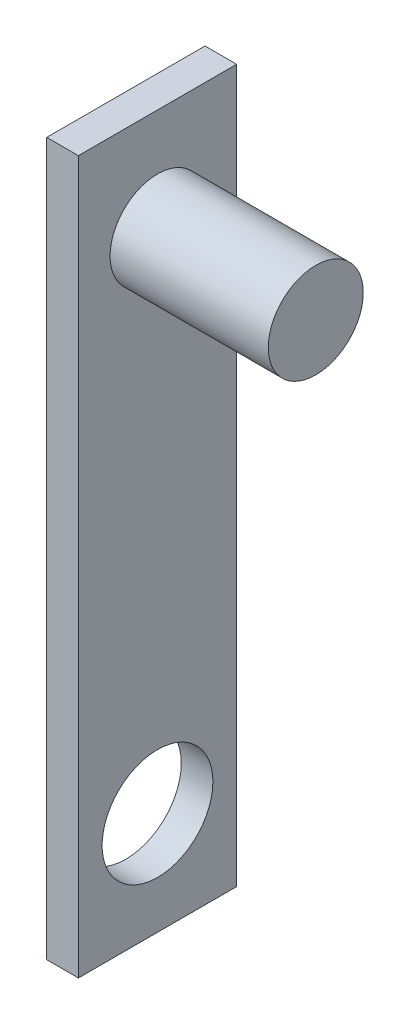
ISO-10303-21;
HEADER;
FILE_DESCRIPTION(('STEP AP214'),'2;1');
FILE_NAME('part.step','',(''),(''),'','','');
FILE_SCHEMA(('AUTOMOTIVE_DESIGN { 1 0 10303 214 1 1 1 1 }'));
ENDSEC;
DATA;
#1=APPLICATION_CONTEXT('core data for automotive mechanical design processes');
#2=APPLICATION_PROTOCOL_DEFINITION('international standard','automotive_design',2000,#1);
#3=PRODUCT_CONTEXT('',#1,'mechanical');
#4=PRODUCT('Part','Part','',(#3));
#5=PRODUCT_RELATED_PRODUCT_CATEGORY('part','',(#4));
#6=PRODUCT_DEFINITION_FORMATION('','',#4);
#7=PRODUCT_DEFINITION_CONTEXT('part definition',#1,'design');
#8=PRODUCT_DEFINITION('design','',#6,#7);
#9=PRODUCT_DEFINITION_SHAPE('','',#8);
#10=(LENGTH_UNIT() NAMED_UNIT(*) SI_UNIT(.MILLI.,.METRE.));
#11=(NAMED_UNIT(*) PLANE_ANGLE_UNIT() SI_UNIT($,.RADIAN.));
#12=(NAMED_UNIT(*) SI_UNIT($,.STERADIAN.) SOLID_ANGLE_UNIT());
#13=UNCERTAINTY_MEASURE_WITH_UNIT(LENGTH_MEASURE(1.E-05),#10,'distance_accuracy_value','');
#14=(GEOMETRIC_REPRESENTATION_CONTEXT(3) GLOBAL_UNCERTAINTY_ASSIGNED_CONTEXT((#13)) GLOBAL_UNIT_ASSIGNED_CONTEXT((#10,
#11,#12)) REPRESENTATION_CONTEXT('',''));
#15=CARTESIAN_POINT('',(0.,0.,0.));
#16=DIRECTION('',(0.,0.,1.));
#17=DIRECTION('',(1.,0.,0.));
#18=AXIS2_PLACEMENT_3D('',#15,#16,#17);
#19=CARTESIAN_POINT('',(2.,0.,0.));
#20=DIRECTION('',(-1.,0.,0.));
#21=DIRECTION('',(0.,0.,1.));
#22=AXIS2_PLACEMENT_3D('',#19,#20,#21);
#23=PLANE('',#22);
#24=DIRECTION('',(0.,1.,0.));
#25=VECTOR('',#24,1.);
#26=CARTESIAN_POINT('',(2.,-22.5,-5.));
#27=LINE('',#26,#25);
#28=CARTESIAN_POINT('',(2.,-22.5,-5.));
#29=VERTEX_POINT('',#28);
#30=CARTESIAN_POINT('',(2.,22.5,-5.));
#31=VERTEX_POINT('',#30);
#32=EDGE_CURVE('E86',#29,#31,#27,.T.);
#33=ORIENTED_EDGE('',*,*,#32,.T.);
#34=DIRECTION('',(0.,0.,1.));
#35=VECTOR('',#34,1.);
#36=CARTESIAN_POINT('',(2.,22.5,5.));
#37=LINE('',#36,#35);
#38=CARTESIAN_POINT('',(2.,22.5,5.));
#39=VERTEX_POINT('',#38);
#40=EDGE_CURVE('E81',#31,#39,#37,.T.);
#41=ORIENTED_EDGE('',*,*,#40,.T.);
#42=DIRECTION('',(0.,-1.,0.));
#43=VECTOR('',#42,1.);
#44=CARTESIAN_POINT('',(2.,-22.5,5.));
#45=LINE('',#44,#43);
#46=CARTESIAN_POINT('',(2.,-22.5,5.));
#47=VERTEX_POINT('',#46);
#48=EDGE_CURVE('E84',#39,#47,#45,.T.);
#49=ORIENTED_EDGE('',*,*,#48,.T.);
#50=DIRECTION('',(0.,0.,-1.));
#51=VECTOR('',#50,1.);
#52=CARTESIAN_POINT('',(2.,-22.5,5.));
#53=LINE('',#52,#51);
#54=EDGE_CURVE('E50',#47,#29,#53,.T.);
#55=ORIENTED_EDGE('',*,*,#54,.T.);
#56=EDGE_LOOP('',(#33,#41,#49,#55));
#57=FACE_BOUND('',#56,.T.);
#58=CARTESIAN_POINT('',(2.,-16.,0.));
#59=DIRECTION('',(1.,0.,0.));
#60=DIRECTION('',(0.,0.,-1.));
#61=AXIS2_PLACEMENT_3D('',#58,#59,#60);
#62=CIRCLE('',#61,3.5);
#63=CARTESIAN_POINT('',(2.,-16.,-3.5));
#64=VERTEX_POINT('',#63);
#65=EDGE_CURVE('E143',#64,#64,#62,.T.);
#66=ORIENTED_EDGE('',*,*,#65,.F.);
#67=EDGE_LOOP('',(#66));
#68=FACE_BOUND('',#67,.T.);
#69=CARTESIAN_POINT('',(2.,16.,0.));
#70=DIRECTION('',(-1.,0.,0.));
#71=DIRECTION('',(0.,0.,1.));
#72=AXIS2_PLACEMENT_3D('',#69,#70,#71);
#73=CIRCLE('',#72,3.);
#74=CARTESIAN_POINT('',(2.,16.,3.));
#75=VERTEX_POINT('',#74);
#76=EDGE_CURVE('E11',#75,#75,#73,.F.);
#77=ORIENTED_EDGE('',*,*,#76,.F.);
#78=EDGE_LOOP('',(#77));
#79=FACE_BOUND('',#78,.T.);
#80=ADVANCED_FACE('F33',(#57,#68,#79),#23,.F.);
#81=CARTESIAN_POINT('',(2.,-22.5,-5.));
#82=DIRECTION('',(0.,0.,1.));
#83=DIRECTION('',(1.,0.,0.));
#84=AXIS2_PLACEMENT_3D('',#81,#82,#83);
#85=PLANE('',#84);
#86=DIRECTION('',(0.,1.,0.));
#87=VECTOR('',#86,1.);
#88=CARTESIAN_POINT('',(0.,-22.5,-5.));
#89=LINE('',#88,#87);
#90=CARTESIAN_POINT('',(0.,-22.5,-5.));
#91=VERTEX_POINT('',#90);
#92=CARTESIAN_POINT('',(0.,22.5,-5.));
#93=VERTEX_POINT('',#92);
#94=EDGE_CURVE('E100',#91,#93,#89,.T.);
#95=ORIENTED_EDGE('',*,*,#94,.T.);
#96=DIRECTION('',(-1.,0.,0.));
#97=VECTOR('',#96,1.);
#98=CARTESIAN_POINT('',(2.,22.5,-5.));
#99=LINE('',#98,#97);
#100=EDGE_CURVE('E42',#31,#93,#99,.T.);
#101=ORIENTED_EDGE('',*,*,#100,.F.);
#102=ORIENTED_EDGE('',*,*,#32,.F.);
#103=DIRECTION('',(-1.,0.,0.));
#104=VECTOR('',#103,1.);
#105=CARTESIAN_POINT('',(2.,-22.5,-5.));
#106=LINE('',#105,#104);
#107=EDGE_CURVE('E96',#29,#91,#106,.T.);
#108=ORIENTED_EDGE('',*,*,#107,.T.);
#109=EDGE_LOOP('',(#95,#101,#102,#108));
#110=FACE_BOUND('',#109,.T.);
#111=ADVANCED_FACE('F35',(#110),#85,.F.);
#112=CARTESIAN_POINT('',(2.,22.5,5.));
#113=DIRECTION('',(0.,-1.,0.));
#114=DIRECTION('',(0.,0.,-1.));
#115=AXIS2_PLACEMENT_3D('',#112,#113,#114);
#116=PLANE('',#115);
#117=DIRECTION('',(0.,0.,1.));
#118=VECTOR('',#117,1.);
#119=CARTESIAN_POINT('',(0.,22.5,5.));
#120=LINE('',#119,#118);
#121=CARTESIAN_POINT('',(0.,22.5,5.));
#122=VERTEX_POINT('',#121);
#123=EDGE_CURVE('E91',#93,#122,#120,.T.);
#124=ORIENTED_EDGE('',*,*,#123,.T.);
#125=DIRECTION('',(-1.,0.,0.));
#126=VECTOR('',#125,1.);
#127=CARTESIAN_POINT('',(2.,22.5,5.));
#128=LINE('',#127,#126);
#129=EDGE_CURVE('E89',#39,#122,#128,.T.);
#130=ORIENTED_EDGE('',*,*,#129,.F.);
#131=ORIENTED_EDGE('',*,*,#40,.F.);
#132=ORIENTED_EDGE('',*,*,#100,.T.);
#133=EDGE_LOOP('',(#124,#130,#131,#132));
#134=FACE_BOUND('',#133,.T.);
#135=ADVANCED_FACE('F90',(#134),#116,.F.);
#136=CARTESIAN_POINT('',(2.,-22.5,5.));
#137=DIRECTION('',(0.,0.,-1.));
#138=DIRECTION('',(-1.,0.,0.));
#139=AXIS2_PLACEMENT_3D('',#136,#137,#138);
#140=PLANE('',#139);
#141=DIRECTION('',(0.,-1.,0.));
#142=VECTOR('',#141,1.);
#143=CARTESIAN_POINT('',(0.,-22.5,5.));
#144=LINE('',#143,#142);
#145=CARTESIAN_POINT('',(0.,-22.5,5.));
#146=VERTEX_POINT('',#145);
#147=EDGE_CURVE('E67',#122,#146,#144,.T.);
#148=ORIENTED_EDGE('',*,*,#147,.T.);
#149=DIRECTION('',(-1.,0.,0.));
#150=VECTOR('',#149,1.);
#151=CARTESIAN_POINT('',(2.,-22.5,5.));
#152=LINE('',#151,#150);
#153=EDGE_CURVE('E92',#47,#146,#152,.T.);
#154=ORIENTED_EDGE('',*,*,#153,.F.);
#155=ORIENTED_EDGE('',*,*,#48,.F.);
#156=ORIENTED_EDGE('',*,*,#129,.T.);
#157=EDGE_LOOP('',(#148,#154,#155,#156));
#158=FACE_BOUND('',#157,.T.);
#159=ADVANCED_FACE('F94',(#158),#140,.F.);
#160=CARTESIAN_POINT('',(2.,-22.5,5.));
#161=DIRECTION('',(0.,1.,0.));
#162=DIRECTION('',(0.,0.,1.));
#163=AXIS2_PLACEMENT_3D('',#160,#161,#162);
#164=PLANE('',#163);
#165=DIRECTION('',(0.,0.,-1.));
#166=VECTOR('',#165,1.);
#167=CARTESIAN_POINT('',(0.,-22.5,5.));
#168=LINE('',#167,#166);
#169=EDGE_CURVE('E73',#146,#91,#168,.T.);
#170=ORIENTED_EDGE('',*,*,#169,.T.);
#171=ORIENTED_EDGE('',*,*,#107,.F.);
#172=ORIENTED_EDGE('',*,*,#54,.F.);
#173=ORIENTED_EDGE('',*,*,#153,.T.);
#174=EDGE_LOOP('',(#170,#171,#172,#173));
#175=FACE_BOUND('',#174,.T.);
#176=ADVANCED_FACE('F114',(#175),#164,.F.);
#177=CARTESIAN_POINT('',(0.,0.,0.));
#178=DIRECTION('',(-1.,0.,0.));
#179=DIRECTION('',(0.,0.,1.));
#180=AXIS2_PLACEMENT_3D('',#177,#178,#179);
#181=PLANE('',#180);
#182=CARTESIAN_POINT('',(0.,-16.,0.));
#183=DIRECTION('',(-1.,0.,0.));
#184=DIRECTION('',(0.,0.,1.));
#185=AXIS2_PLACEMENT_3D('',#182,#183,#184);
#186=CIRCLE('',#185,3.5);
#187=CARTESIAN_POINT('',(0.,-16.,3.5));
#188=VERTEX_POINT('',#187);
#189=EDGE_CURVE('E103',#188,#188,#186,.F.);
#190=ORIENTED_EDGE('',*,*,#189,.T.);
#191=EDGE_LOOP('',(#190));
#192=FACE_BOUND('',#191,.T.);
#193=ORIENTED_EDGE('',*,*,#94,.F.);
#194=ORIENTED_EDGE('',*,*,#169,.F.);
#195=ORIENTED_EDGE('',*,*,#147,.F.);
#196=ORIENTED_EDGE('',*,*,#123,.F.);
#197=EDGE_LOOP('',(#193,#194,#195,#196));
#198=FACE_BOUND('',#197,.T.);
#199=ADVANCED_FACE('F111',(#192,#198),#181,.T.);
#200=CARTESIAN_POINT('',(-9.89949493661166,-16.,0.));
#201=DIRECTION('',(1.,0.,0.));
#202=DIRECTION('',(0.,0.,-1.));
#203=AXIS2_PLACEMENT_3D('',#200,#201,#202);
#204=CYLINDRICAL_SURFACE('',#203,3.5);
#205=ORIENTED_EDGE('',*,*,#65,.T.);
#206=EDGE_LOOP('',(#205));
#207=FACE_BOUND('',#206,.T.);
#208=ORIENTED_EDGE('',*,*,#189,.F.);
#209=EDGE_LOOP('',(#208));
#210=FACE_BOUND('',#209,.T.);
#211=ADVANCED_FACE('F113',(#207,#210),#204,.F.);
#212=CARTESIAN_POINT('',(12.,16.,0.));
#213=DIRECTION('',(-1.,0.,0.));
#214=DIRECTION('',(0.,0.,1.));
#215=AXIS2_PLACEMENT_3D('',#212,#213,#214);
#216=CYLINDRICAL_SURFACE('',#215,3.);
#217=CARTESIAN_POINT('',(12.,16.,0.));
#218=DIRECTION('',(1.,0.,0.));
#219=DIRECTION('',(0.,0.,-1.));
#220=AXIS2_PLACEMENT_3D('',#217,#218,#219);
#221=CIRCLE('',#220,3.);
#222=CARTESIAN_POINT('',(12.,16.,-3.));
#223=VERTEX_POINT('',#222);
#224=EDGE_CURVE('E142',#223,#223,#221,.T.);
#225=ORIENTED_EDGE('',*,*,#224,.F.);
#226=EDGE_LOOP('',(#225));
#227=FACE_BOUND('',#226,.T.);
#228=ORIENTED_EDGE('',*,*,#76,.T.);
#229=EDGE_LOOP('',(#228));
#230=FACE_BOUND('',#229,.T.);
#231=ADVANCED_FACE('F121',(#227,#230),#216,.T.);
#232=CARTESIAN_POINT('',(12.,16.,0.));
#233=DIRECTION('',(1.,0.,0.));
#234=DIRECTION('',(0.,0.,-1.));
#235=AXIS2_PLACEMENT_3D('',#232,#233,#234);
#236=PLANE('',#235);
#237=ORIENTED_EDGE('',*,*,#224,.T.);
#238=EDGE_LOOP('',(#237));
#239=FACE_BOUND('',#238,.T.);
#240=ADVANCED_FACE('F134',(#239),#236,.T.);
#241=CLOSED_SHELL('',(#80,#111,#135,#159,#176,#199,#211,#231,#240));
#242=MANIFOLD_SOLID_BREP('B2',#241);
#243=ADVANCED_BREP_SHAPE_REPRESENTATION('',(#18,#242),#14);
#244=SHAPE_DEFINITION_REPRESENTATION(#9,#243);
ENDSEC;
END-ISO-10303-21;
